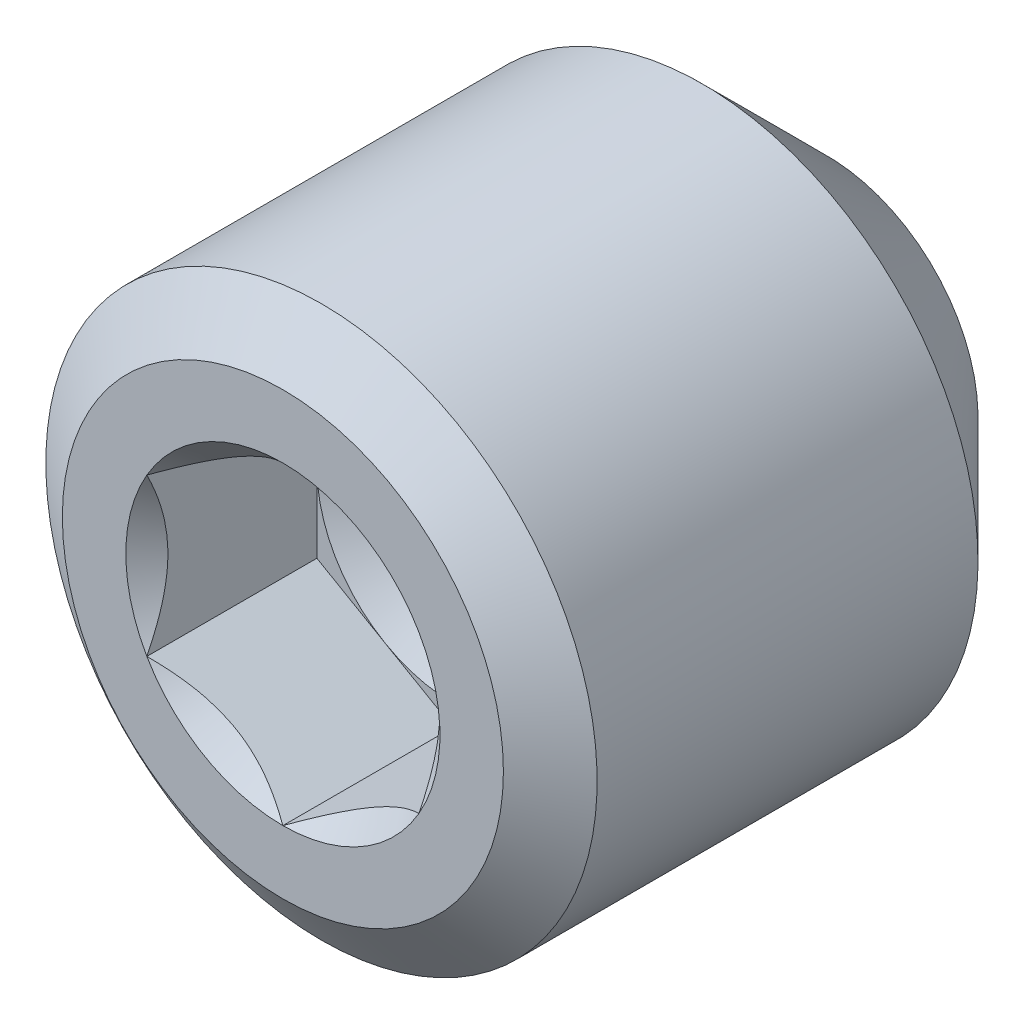
ISO-10303-21;
HEADER;
FILE_DESCRIPTION(('STEP AP214'),'2;1');
FILE_NAME('part.step','',(''),(''),'','','');
FILE_SCHEMA(('AUTOMOTIVE_DESIGN { 1 0 10303 214 1 1 1 1 }'));
ENDSEC;
DATA;
#1=APPLICATION_CONTEXT('core data for automotive mechanical design processes');
#2=APPLICATION_PROTOCOL_DEFINITION('international standard','automotive_design',2000,#1);
#3=PRODUCT_CONTEXT('',#1,'mechanical');
#4=PRODUCT('Part','Part','',(#3));
#5=PRODUCT_RELATED_PRODUCT_CATEGORY('part','',(#4));
#6=PRODUCT_DEFINITION_FORMATION('','',#4);
#7=PRODUCT_DEFINITION_CONTEXT('part definition',#1,'design');
#8=PRODUCT_DEFINITION('design','',#6,#7);
#9=PRODUCT_DEFINITION_SHAPE('','',#8);
#10=(LENGTH_UNIT() NAMED_UNIT(*) SI_UNIT(.MILLI.,.METRE.));
#11=(NAMED_UNIT(*) PLANE_ANGLE_UNIT() SI_UNIT($,.RADIAN.));
#12=(NAMED_UNIT(*) SI_UNIT($,.STERADIAN.) SOLID_ANGLE_UNIT());
#13=UNCERTAINTY_MEASURE_WITH_UNIT(LENGTH_MEASURE(1.E-05),#10,'distance_accuracy_value','');
#14=(GEOMETRIC_REPRESENTATION_CONTEXT(3) GLOBAL_UNCERTAINTY_ASSIGNED_CONTEXT((#13)) GLOBAL_UNIT_ASSIGNED_CONTEXT((#10,
#11,#12)) REPRESENTATION_CONTEXT('',''));
#15=CARTESIAN_POINT('',(0.,0.,0.));
#16=DIRECTION('',(0.,0.,1.));
#17=DIRECTION('',(1.,0.,0.));
#18=AXIS2_PLACEMENT_3D('',#15,#16,#17);
#19=CARTESIAN_POINT('',(0.,0.,0.495727982126937));
#20=DIRECTION('',(0.,0.,1.));
#21=DIRECTION('',(0.,-1.,0.));
#22=AXIS2_PLACEMENT_3D('',#19,#20,#21);
#23=CONICAL_SURFACE('',#22,1.19062499987876,1.04719755103086);
#24=CARTESIAN_POINT('',(2.55795384873636E-10,0.,-0.19167968210354));
#25=VERTEX_POINT('',#24);
#26=VERTEX_LOOP('',#25);
#27=FACE_BOUND('',#26,.T.);
#28=CARTESIAN_POINT('',(0.,0.,0.495727982192574));
#29=DIRECTION('',(0.,0.,1.));
#30=DIRECTION('',(0.,-1.,0.));
#31=AXIS2_PLACEMENT_3D('',#28,#29,#30);
#32=CIRCLE('',#31,1.19062499999245);
#33=CARTESIAN_POINT('',(1.19062499999623,0.,0.495727982183542));
#34=VERTEX_POINT('',#33);
#35=CARTESIAN_POINT('',(0.595312499998112,-1.03111149637757,0.495727982183542));
#36=VERTEX_POINT('',#35);
#37=EDGE_CURVE('E101',#34,#36,#32,.F.);
#38=ORIENTED_EDGE('',*,*,#37,.F.);
#39=CARTESIAN_POINT('',(0.,0.,0.495727982192574));
#40=DIRECTION('',(0.,0.,1.));
#41=DIRECTION('',(0.,-1.,0.));
#42=AXIS2_PLACEMENT_3D('',#39,#40,#41);
#43=CIRCLE('',#42,1.19062499999245);
#44=CARTESIAN_POINT('',(0.59531249999812,1.03111149637759,0.495727982183542));
#45=VERTEX_POINT('',#44);
#46=EDGE_CURVE('E115',#45,#34,#43,.F.);
#47=ORIENTED_EDGE('',*,*,#46,.F.);
#48=CARTESIAN_POINT('',(0.,0.,0.495727982192574));
#49=DIRECTION('',(0.,0.,1.));
#50=DIRECTION('',(0.,-1.,0.));
#51=AXIS2_PLACEMENT_3D('',#48,#49,#50);
#52=CIRCLE('',#51,1.19062499999245);
#53=CARTESIAN_POINT('',(-0.595312499998102,1.0311114963776,0.495727982183538));
#54=VERTEX_POINT('',#53);
#55=EDGE_CURVE('E253',#54,#45,#52,.F.);
#56=ORIENTED_EDGE('',*,*,#55,.F.);
#57=CARTESIAN_POINT('',(0.,0.,0.495727982192574));
#58=DIRECTION('',(0.,0.,1.));
#59=DIRECTION('',(0.,-1.,0.));
#60=AXIS2_PLACEMENT_3D('',#57,#58,#59);
#61=CIRCLE('',#60,1.19062499999245);
#62=CARTESIAN_POINT('',(-1.19062499999622,1.30013777685213E-13,0.495727982183538));
#63=VERTEX_POINT('',#62);
#64=EDGE_CURVE('E152',#63,#54,#61,.F.);
#65=ORIENTED_EDGE('',*,*,#64,.F.);
#66=CARTESIAN_POINT('',(0.,0.,0.495727982192574));
#67=DIRECTION('',(0.,0.,1.));
#68=DIRECTION('',(0.,-1.,0.));
#69=AXIS2_PLACEMENT_3D('',#66,#67,#68);
#70=CIRCLE('',#69,1.19062499999245);
#71=CARTESIAN_POINT('',(-0.595312499998087,-1.03111149637758,0.495727982183542));
#72=VERTEX_POINT('',#71);
#73=EDGE_CURVE('E20',#72,#63,#70,.F.);
#74=ORIENTED_EDGE('',*,*,#73,.F.);
#75=CARTESIAN_POINT('',(0.,0.,0.495727982192574));
#76=DIRECTION('',(0.,0.,1.));
#77=DIRECTION('',(0.,-1.,0.));
#78=AXIS2_PLACEMENT_3D('',#75,#76,#77);
#79=CIRCLE('',#78,1.19062499999245);
#80=EDGE_CURVE('E374',#36,#72,#79,.F.);
#81=ORIENTED_EDGE('',*,*,#80,.F.);
#82=EDGE_LOOP('',(#38,#47,#56,#65,#74,#81));
#83=FACE_BOUND('',#82,.T.);
#84=ADVANCED_FACE('F17',(#27,#83),#23,.F.);
#85=CARTESIAN_POINT('',(-1.190625,2.06222299276171,0.49572798217451));
#86=DIRECTION('',(0.,0.,1.));
#87=DIRECTION('',(0.,-1.,0.));
#88=AXIS2_PLACEMENT_3D('',#85,#86,#87);
#89=PLANE('',#88);
#90=DIRECTION('',(0.,-1.,0.));
#91=VECTOR('',#90,1.);
#92=CARTESIAN_POINT('',(-1.190625,0.687407664253913,0.49572798217451));
#93=LINE('',#92,#91);
#94=CARTESIAN_POINT('',(-1.19062500000001,-0.687407664253882,0.49572798217451));
#95=VERTEX_POINT('',#94);
#96=EDGE_CURVE('E84',#63,#95,#93,.T.);
#97=ORIENTED_EDGE('',*,*,#96,.T.);
#98=DIRECTION('',(0.866025403784438,-0.500000000000001,0.));
#99=VECTOR('',#98,1.);
#100=CARTESIAN_POINT('',(-1.190625,-0.687407664253889,0.49572798217451));
#101=LINE('',#100,#99);
#102=EDGE_CURVE('E168',#95,#72,#101,.T.);
#103=ORIENTED_EDGE('',*,*,#102,.T.);
#104=ORIENTED_EDGE('',*,*,#73,.T.);
#105=EDGE_LOOP('',(#97,#103,#104));
#106=FACE_BOUND('',#105,.T.);
#107=ADVANCED_FACE('F270',(#106),#89,.T.);
#108=CARTESIAN_POINT('',(-1.190625,2.06222299276171,0.49572798217451));
#109=DIRECTION('',(0.,0.,1.));
#110=DIRECTION('',(0.,-1.,0.));
#111=AXIS2_PLACEMENT_3D('',#108,#109,#110);
#112=PLANE('',#111);
#113=DIRECTION('',(0.866025403784438,-0.500000000000001,0.));
#114=VECTOR('',#113,1.);
#115=CARTESIAN_POINT('',(-1.190625,-0.687407664253889,0.495727982174503));
#116=LINE('',#115,#114);
#117=CARTESIAN_POINT('',(0.,-1.37481532850779,0.495727982174507));
#118=VERTEX_POINT('',#117);
#119=EDGE_CURVE('E134',#72,#118,#116,.T.);
#120=ORIENTED_EDGE('',*,*,#119,.T.);
#121=DIRECTION('',(0.866025403784439,0.5,0.));
#122=VECTOR('',#121,1.);
#123=CARTESIAN_POINT('',(0.,-1.37481532850779,0.49572798217451));
#124=LINE('',#123,#122);
#125=EDGE_CURVE('E106',#118,#36,#124,.T.);
#126=ORIENTED_EDGE('',*,*,#125,.T.);
#127=ORIENTED_EDGE('',*,*,#80,.T.);
#128=EDGE_LOOP('',(#120,#126,#127));
#129=FACE_BOUND('',#128,.T.);
#130=ADVANCED_FACE('F268',(#129),#112,.T.);
#131=CARTESIAN_POINT('',(-1.190625,2.06222299276171,0.49572798217451));
#132=DIRECTION('',(0.,0.,1.));
#133=DIRECTION('',(0.,-1.,0.));
#134=AXIS2_PLACEMENT_3D('',#131,#132,#133);
#135=PLANE('',#134);
#136=DIRECTION('',(0.866025403784439,0.5,0.));
#137=VECTOR('',#136,1.);
#138=CARTESIAN_POINT('',(0.,-1.37481532850779,0.49572798217451));
#139=LINE('',#138,#137);
#140=CARTESIAN_POINT('',(1.19062500000001,-0.687407664253884,0.49572798217451));
#141=VERTEX_POINT('',#140);
#142=EDGE_CURVE('E96',#36,#141,#139,.T.);
#143=ORIENTED_EDGE('',*,*,#142,.T.);
#144=DIRECTION('',(0.,1.,0.));
#145=VECTOR('',#144,1.);
#146=CARTESIAN_POINT('',(1.19062500000001,-0.687407664253889,0.49572798217451));
#147=LINE('',#146,#145);
#148=EDGE_CURVE('E99',#141,#34,#147,.T.);
#149=ORIENTED_EDGE('',*,*,#148,.T.);
#150=ORIENTED_EDGE('',*,*,#37,.T.);
#151=EDGE_LOOP('',(#143,#149,#150));
#152=FACE_BOUND('',#151,.T.);
#153=ADVANCED_FACE('F98',(#152),#135,.T.);
#154=CARTESIAN_POINT('',(-1.190625,2.06222299276171,0.49572798217451));
#155=DIRECTION('',(0.,0.,1.));
#156=DIRECTION('',(0.,-1.,0.));
#157=AXIS2_PLACEMENT_3D('',#154,#155,#156);
#158=PLANE('',#157);
#159=DIRECTION('',(0.,1.,0.));
#160=VECTOR('',#159,1.);
#161=CARTESIAN_POINT('',(1.19062500000001,-0.687407664253889,0.495727982174509));
#162=LINE('',#161,#160);
#163=CARTESIAN_POINT('',(1.19062500000003,0.687407664253898,0.495727982174509));
#164=VERTEX_POINT('',#163);
#165=EDGE_CURVE('E114',#34,#164,#162,.T.);
#166=ORIENTED_EDGE('',*,*,#165,.T.);
#167=DIRECTION('',(-0.866025403784438,0.500000000000001,0.));
#168=VECTOR('',#167,1.);
#169=CARTESIAN_POINT('',(1.19062500000001,0.687407664253913,0.49572798217451));
#170=LINE('',#169,#168);
#171=EDGE_CURVE('E125',#164,#45,#170,.T.);
#172=ORIENTED_EDGE('',*,*,#171,.T.);
#173=ORIENTED_EDGE('',*,*,#46,.T.);
#174=EDGE_LOOP('',(#166,#172,#173));
#175=FACE_BOUND('',#174,.T.);
#176=ADVANCED_FACE('F261',(#175),#158,.T.);
#177=CARTESIAN_POINT('',(1.19062500000001,-0.687407664253889,0.49572798217451));
#178=DIRECTION('',(1.,0.,0.));
#179=DIRECTION('',(0.,1.,0.));
#180=AXIS2_PLACEMENT_3D('',#177,#178,#179);
#181=PLANE('',#180);
#182=CARTESIAN_POINT('',(1.19062499999567,0.687407664292412,1.98400923211493));
#183=CARTESIAN_POINT('',(1.19062499999845,0.64046328207789,1.96055894231477));
#184=CARTESIAN_POINT('',(1.19062499999959,0.592738991388445,1.9384779182468));
#185=CARTESIAN_POINT('',(1.19062500000044,0.495406225216116,1.89800295513959));
#186=CARTESIAN_POINT('',(1.19062500000013,0.44578762950972,1.87963356850329));
#187=CARTESIAN_POINT('',(1.1906249999999,0.345116375712698,1.84791358583569));
#188=CARTESIAN_POINT('',(1.19062499999999,0.294069215443057,1.83454600462254));
#189=CARTESIAN_POINT('',(1.19062500000004,0.190855854638069,1.81396603547193));
#190=CARTESIAN_POINT('',(1.19062500000002,0.138693632939681,1.80673461351588));
#191=CARTESIAN_POINT('',(1.19062500000001,0.0719511128628457,1.80190389372895));
#192=CARTESIAN_POINT('',(1.19062500000001,0.0575681065477679,1.80112291749238));
#193=CARTESIAN_POINT('',(1.19062500000001,0.0287907386471924,1.80008032792779));
#194=CARTESIAN_POINT('',(1.19062500000001,0.0143963874866042,1.79981843246661));
#195=CARTESIAN_POINT('',(1.19062500000001,-0.0361321030513867,1.79982008619966));
#196=CARTESIAN_POINT('',(1.19062500000001,-0.0722770331511759,1.80147394594884));
#197=CARTESIAN_POINT('',(1.19062500000001,-0.144284982609329,1.80799116289963));
#198=CARTESIAN_POINT('',(1.19062500000001,-0.180147787674807,1.81285675864882));
#199=CARTESIAN_POINT('',(1.19062500000001,-0.287258251714067,1.83196696983393));
#200=CARTESIAN_POINT('',(1.19062500000001,-0.35772529740189,1.85072176782421));
#201=CARTESIAN_POINT('',(1.19062500000001,-0.471552892507442,1.88908925370762));
#202=CARTESIAN_POINT('',(1.19062500000001,-0.515840765958847,1.90614997876308));
#203=CARTESIAN_POINT('',(1.19062500000001,-0.602739573147029,1.94312607455083));
#204=CARTESIAN_POINT('',(1.19062500000001,-0.645362139970547,1.96301390794479));
#205=CARTESIAN_POINT('',(1.19062500000001,-0.687407664293118,1.98400923211292));
#206=B_SPLINE_CURVE_WITH_KNOTS('',3,(#182,#183,#184,#185,#186,#187,#188,#189,#190,#191,#192,
#193,#194,#195,#196,#197,#198,#199,#200,#201,#202,#203,#204,#205),.UNSPECIFIED.,.F.,.F.,(4,2,2,
2,2,2,2,2,2,2,2,4),(0.,0.157535403142992,0.316081041540045,0.474083294698365,0.631593623243647,
0.674799715139207,0.717982317014592,0.826362160391399,0.934817623300469,1.15262451060987,
1.29491478060776,1.43590359051227),.UNSPECIFIED.);
#207=CARTESIAN_POINT('',(1.19062500005789,0.687407664240221,1.98400923213658));
#208=VERTEX_POINT('',#207);
#209=CARTESIAN_POINT('',(1.19062500002894,-0.687407664270611,1.98400923212671));
#210=VERTEX_POINT('',#209);
#211=EDGE_CURVE('E160',#208,#210,#206,.T.);
#212=ORIENTED_EDGE('',*,*,#211,.F.);
#213=DIRECTION('',(0.,0.,1.));
#214=VECTOR('',#213,1.);
#215=CARTESIAN_POINT('',(1.19062500000003,0.687407664253898,0.49572798217451));
#216=LINE('',#215,#214);
#217=EDGE_CURVE('E140',#208,#164,#216,.F.);
#218=ORIENTED_EDGE('',*,*,#217,.T.);
#219=ORIENTED_EDGE('',*,*,#165,.F.);
#220=ORIENTED_EDGE('',*,*,#148,.F.);
#221=DIRECTION('',(0.,0.,1.));
#222=VECTOR('',#221,1.);
#223=CARTESIAN_POINT('',(1.19062500000001,-0.687407664253884,0.49572798217451));
#224=LINE('',#223,#222);
#225=EDGE_CURVE('E105',#141,#210,#224,.T.);
#226=ORIENTED_EDGE('',*,*,#225,.T.);
#227=EDGE_LOOP('',(#212,#218,#219,#220,#226));
#228=FACE_BOUND('',#227,.T.);
#229=ADVANCED_FACE('F111',(#228),#181,.F.);
#230=CARTESIAN_POINT('',(-1.190625,2.06222299276171,0.49572798217451));
#231=DIRECTION('',(0.,0.,1.));
#232=DIRECTION('',(0.,-1.,0.));
#233=AXIS2_PLACEMENT_3D('',#230,#231,#232);
#234=PLANE('',#233);
#235=DIRECTION('',(-0.866025403784438,0.500000000000001,0.));
#236=VECTOR('',#235,1.);
#237=CARTESIAN_POINT('',(1.19062500000001,0.687407664253913,0.495727982174503));
#238=LINE('',#237,#236);
#239=CARTESIAN_POINT('',(0.,1.37481532850782,0.495727982174503));
#240=VERTEX_POINT('',#239);
#241=EDGE_CURVE('E137',#45,#240,#238,.T.);
#242=ORIENTED_EDGE('',*,*,#241,.T.);
#243=DIRECTION('',(-0.866025403784439,-0.5,0.));
#244=VECTOR('',#243,1.);
#245=CARTESIAN_POINT('',(0.,1.37481532850781,0.495727982174503));
#246=LINE('',#245,#244);
#247=EDGE_CURVE('E143',#240,#54,#246,.T.);
#248=ORIENTED_EDGE('',*,*,#247,.T.);
#249=ORIENTED_EDGE('',*,*,#55,.T.);
#250=EDGE_LOOP('',(#242,#248,#249));
#251=FACE_BOUND('',#250,.T.);
#252=ADVANCED_FACE('F260',(#251),#234,.T.);
#253=CARTESIAN_POINT('',(-1.190625,2.06222299276171,0.49572798217451));
#254=DIRECTION('',(0.,0.,1.));
#255=DIRECTION('',(0.,-1.,0.));
#256=AXIS2_PLACEMENT_3D('',#253,#254,#255);
#257=PLANE('',#256);
#258=DIRECTION('',(-0.866025403784439,-0.5,0.));
#259=VECTOR('',#258,1.);
#260=CARTESIAN_POINT('',(0.,1.37481532850781,0.495727982174501));
#261=LINE('',#260,#259);
#262=CARTESIAN_POINT('',(-1.190625,0.687407664253916,0.495727982174502));
#263=VERTEX_POINT('',#262);
#264=EDGE_CURVE('E146',#54,#263,#261,.T.);
#265=ORIENTED_EDGE('',*,*,#264,.T.);
#266=DIRECTION('',(0.,-1.,0.));
#267=VECTOR('',#266,1.);
#268=CARTESIAN_POINT('',(-1.190625,0.687407664253913,0.495727982174503));
#269=LINE('',#268,#267);
#270=EDGE_CURVE('E149',#263,#63,#269,.T.);
#271=ORIENTED_EDGE('',*,*,#270,.T.);
#272=ORIENTED_EDGE('',*,*,#64,.T.);
#273=EDGE_LOOP('',(#265,#271,#272));
#274=FACE_BOUND('',#273,.T.);
#275=ADVANCED_FACE('F360',(#274),#257,.T.);
#276=CARTESIAN_POINT('',(-1.190625,0.687407664253913,0.495727982174503));
#277=DIRECTION('',(-1.,0.,0.));
#278=DIRECTION('',(0.,-1.,0.));
#279=AXIS2_PLACEMENT_3D('',#276,#277,#278);
#280=PLANE('',#279);
#281=CARTESIAN_POINT('',(-1.19062499999689,0.687407664295069,1.98400923211557));
#282=CARTESIAN_POINT('',(-1.19062499999888,0.640154592187732,1.96040536744382));
#283=CARTESIAN_POINT('',(-1.1906249999997,0.592111444465279,1.93818802847305));
#284=CARTESIAN_POINT('',(-1.1906250000003,0.494146535985991,1.89750902941694));
#285=CARTESIAN_POINT('',(-1.19062500000008,0.444215463852093,1.87906999571823));
#286=CARTESIAN_POINT('',(-1.19062499999992,0.34353191261821,1.84748380274731));
#287=CARTESIAN_POINT('',(-1.19062499999998,0.292805060660136,1.83425727427473));
#288=CARTESIAN_POINT('',(-1.19062500000002,0.19023488957445,1.81387930355028));
#289=CARTESIAN_POINT('',(-1.190625,0.138394701629495,1.80671265556526));
#290=CARTESIAN_POINT('',(-1.19062499999999,0.0490434171471756,1.80024610055994));
#291=CARTESIAN_POINT('',(-1.190625,0.0116476312291625,1.79928918177737));
#292=CARTESIAN_POINT('',(-1.190625,-0.0630781169061416,1.80090396128143));
#293=CARTESIAN_POINT('',(-1.190625,-0.100408062759505,1.80347643902957));
#294=CARTESIAN_POINT('',(-1.190625,-0.174707550763351,1.81200130363095));
#295=CARTESIAN_POINT('',(-1.190625,-0.211676725216807,1.81795683341918));
#296=CARTESIAN_POINT('',(-1.190625,-0.284997830944034,1.83292705321312));
#297=CARTESIAN_POINT('',(-1.190625,-0.321349490320898,1.84194305589422));
#298=CARTESIAN_POINT('',(-1.190625,-0.414409407701737,1.86868846791361));
#299=CARTESIAN_POINT('',(-1.190625,-0.47053205911329,1.88842523325998));
#300=CARTESIAN_POINT('',(-1.190625,-0.580581647456373,1.93288237138799));
#301=CARTESIAN_POINT('',(-1.190625,-0.634515062273283,1.95758652132262));
#302=CARTESIAN_POINT('',(-1.190625,-0.687407664295433,1.98400923211406));
#303=B_SPLINE_CURVE_WITH_KNOTS('',3,(#281,#282,#283,#284,#285,#286,#287,#288,#289,#290,#291,
#292,#293,#294,#295,#296,#297,#298,#299,#300,#301,#302),.UNSPECIFIED.,.F.,.F.,(4,2,2,2,2,2,2,2,
2,2,4),(0.,0.158570945782174,0.318065397827539,0.475027617267219,0.631594801071171,
0.743660160759135,0.855750273884749,0.967944692071428,1.08018729279008,1.25836291045195,
1.43596581394394),.UNSPECIFIED.);
#304=CARTESIAN_POINT('',(-1.19062500002893,0.687407664270642,1.98400923212671));
#305=VERTEX_POINT('',#304);
#306=CARTESIAN_POINT('',(-1.19062500005789,-0.687407664241365,1.98400923213716));
#307=VERTEX_POINT('',#306);
#308=EDGE_CURVE('E315',#305,#307,#303,.T.);
#309=ORIENTED_EDGE('',*,*,#308,.T.);
#310=DIRECTION('',(0.,0.,1.));
#311=VECTOR('',#310,1.);
#312=CARTESIAN_POINT('',(-1.19062500000001,-0.687407664253882,0.49572798217451));
#313=LINE('',#312,#311);
#314=EDGE_CURVE('E132',#307,#95,#313,.F.);
#315=ORIENTED_EDGE('',*,*,#314,.T.);
#316=ORIENTED_EDGE('',*,*,#96,.F.);
#317=ORIENTED_EDGE('',*,*,#270,.F.);
#318=DIRECTION('',(0.,0.,1.));
#319=VECTOR('',#318,1.);
#320=CARTESIAN_POINT('',(-1.190625,0.687407664253916,0.495727982174503));
#321=LINE('',#320,#319);
#322=EDGE_CURVE('E156',#263,#305,#321,.T.);
#323=ORIENTED_EDGE('',*,*,#322,.T.);
#324=EDGE_LOOP('',(#309,#315,#316,#317,#323));
#325=FACE_BOUND('',#324,.T.);
#326=ADVANCED_FACE('F332',(#325),#280,.F.);
#327=CARTESIAN_POINT('',(-1.190625,-0.687407664253889,0.49572798217451));
#328=DIRECTION('',(-0.500000000000001,-0.866025403784438,0.));
#329=DIRECTION('',(0.866025403784438,-0.500000000000001,0.));
#330=AXIS2_PLACEMENT_3D('',#327,#328,#329);
#331=PLANE('',#330);
#332=CARTESIAN_POINT('',(-1.19062500003409,-0.687407664230629,1.98400923211556));
#333=CARTESIAN_POINT('',(-1.14970263918327,-0.711034200286016,1.96040536744382));
#334=CARTESIAN_POINT('',(-1.10809605277826,-0.73505577414795,1.93818802847304));
#335=CARTESIAN_POINT('',(-1.02325595335608,-0.784038228388114,1.89750902941694));
#336=CARTESIAN_POINT('',(-0.980014376449825,-0.809003764454871,1.87906999571824));
#337=CARTESIAN_POINT('',(-0.892819863337972,-0.859345540071674,1.84748380274731));
#338=CARTESIAN_POINT('',(-0.848889120888296,-0.884708966050761,1.83425727427474));
#339=CARTESIAN_POINT('',(-0.760060747057598,-0.93599405159364,1.81387930355029));
#340=CARTESIAN_POINT('',(-0.7151658273603,-0.961914145566103,1.80671265556527));
#341=CARTESIAN_POINT('',(-0.637785345137838,-1.00658978780726,1.80024610055994));
#342=CARTESIAN_POINT('',(-0.605399644538355,-1.02528768076626,1.79928918177737));
#343=CARTESIAN_POINT('',(-0.540685248336385,-1.06265055483392,1.80090396128143));
#344=CARTESIAN_POINT('',(-0.508356566905474,-1.0813155277606,1.80347643902958));
#345=CARTESIAN_POINT('',(-0.444011322805966,-1.11846527176252,1.81200130363096));
#346=CARTESIAN_POINT('',(-0.411995078572333,-1.13694985898925,1.81795683341919));
#347=CARTESIAN_POINT('',(-0.348497138378991,-1.17361041185286,1.83292705321313));
#348=CARTESIAN_POINT('',(-0.317015677888907,-1.1917862415413,1.84194305589423));
#349=CARTESIAN_POINT('',(-0.23642342536302,-1.23831620023172,1.86868846791362));
#350=CARTESIAN_POINT('',(-0.187819783512878,-1.26637752593749,1.88842523325998));
#351=CARTESIAN_POINT('',(-0.0925140443317499,-1.32140232010903,1.932882371388));
#352=CARTESIAN_POINT('',(-0.0458063369874632,-1.34836902751749,1.95758652132262));
#353=CARTESIAN_POINT('',(3.59776575595635E-11,-1.37481532852856,1.98400923211406));
#354=B_SPLINE_CURVE_WITH_KNOTS('',3,(#332,#333,#334,#335,#336,#337,#338,#339,#340,#341,#342,
#343,#344,#345,#346,#347,#348,#349,#350,#351,#352,#353),.UNSPECIFIED.,.F.,.F.,(4,2,2,2,2,2,2,2,
2,2,4),(0.,0.158570945782172,0.318065397827535,0.475027617267213,0.631594801071163,
0.743660160759127,0.855750273884742,0.967944692071422,1.08018729279007,1.25836291045194,
1.43596581394393),.UNSPECIFIED.);
#355=CARTESIAN_POINT('',(-3.97893440011964E-11,-1.37481532855166,1.98400923213716));
#356=VERTEX_POINT('',#355);
#357=EDGE_CURVE('E320',#307,#356,#354,.T.);
#358=ORIENTED_EDGE('',*,*,#357,.T.);
#359=DIRECTION('',(0.,0.,1.));
#360=VECTOR('',#359,1.);
#361=CARTESIAN_POINT('',(0.,-1.3748153285078,0.49572798217451));
#362=LINE('',#361,#360);
#363=EDGE_CURVE('E122',#356,#118,#362,.F.);
#364=ORIENTED_EDGE('',*,*,#363,.T.);
#365=ORIENTED_EDGE('',*,*,#119,.F.);
#366=ORIENTED_EDGE('',*,*,#102,.F.);
#367=ORIENTED_EDGE('',*,*,#314,.F.);
#368=EDGE_LOOP('',(#358,#364,#365,#366,#367));
#369=FACE_BOUND('',#368,.T.);
#370=ADVANCED_FACE('F353',(#369),#331,.F.);
#371=CARTESIAN_POINT('',(0.,-1.37481532850779,0.49572798217451));
#372=DIRECTION('',(0.5,-0.866025403784439,0.));
#373=DIRECTION('',(0.866025403784439,0.5,0.));
#374=AXIS2_PLACEMENT_3D('',#371,#372,#373);
#375=PLANE('',#374);
#376=CARTESIAN_POINT('',(-3.7187299035962E-11,-1.37481532852568,1.98400923211557));
#377=CARTESIAN_POINT('',(0.0409223608156151,-1.35118879247373,1.96040536744382));
#378=CARTESIAN_POINT('',(0.0825289472214342,-1.32716721861321,1.93818802847305));
#379=CARTESIAN_POINT('',(0.167369046644212,-1.27818476437409,1.89750902941694));
#380=CARTESIAN_POINT('',(0.210610623550247,-1.25321922830695,1.87906999571824));
#381=CARTESIAN_POINT('',(0.297805136661942,-1.20287745268987,1.84748380274731));
#382=CARTESIAN_POINT('',(0.341735879111678,-1.17751402671088,1.83425727427474));
#383=CARTESIAN_POINT('',(0.430564252942422,-1.12622894116808,1.81387930355029));
#384=CARTESIAN_POINT('',(0.475459172639706,-1.10030884719558,1.80671265556527));
#385=CARTESIAN_POINT('',(0.552839654862164,-1.05563320495441,1.80024610055994));
#386=CARTESIAN_POINT('',(0.58522535546165,-1.03693531199541,1.79928918177737));
#387=CARTESIAN_POINT('',(0.649939751663623,-0.999572437927758,1.80090396128143));
#388=CARTESIAN_POINT('',(0.682268433094534,-0.980907465001075,1.80347643902958));
#389=CARTESIAN_POINT('',(0.746613677194042,-0.943757720999152,1.81200130363096));
#390=CARTESIAN_POINT('',(0.778629921427674,-0.925273133772424,1.81795683341919));
#391=CARTESIAN_POINT('',(0.842127861621015,-0.888612580908812,1.83292705321313));
#392=CARTESIAN_POINT('',(0.873609322111098,-0.87043675122038,1.84194305589423));
#393=CARTESIAN_POINT('',(0.954201574636604,-0.82390679253018,1.86868846791349));
#394=CARTESIAN_POINT('',(1.00280521648638,-0.795845466824616,1.88842523325968));
#395=CARTESIAN_POINT('',(1.0981109556668,-0.740820672653482,1.93288237138728));
#396=CARTESIAN_POINT('',(1.14481866301075,-0.713853965245223,1.95758652132166));
#397=CARTESIAN_POINT('',(1.19062500003387,-0.687407664234335,1.98400923211284));
#398=B_SPLINE_CURVE_WITH_KNOTS('',3,(#376,#377,#378,#379,#380,#381,#382,#383,#384,#385,#386,
#387,#388,#389,#390,#391,#392,#393,#394,#395,#396,#397),.UNSPECIFIED.,.F.,.F.,(4,2,2,2,2,2,2,2,
2,2,4),(0.,0.158570945782166,0.318065397827523,0.475027617267209,0.631594801071167,
0.743660160759134,0.855750273884751,0.967944692071429,1.08018729279008,1.25836291045058,
1.43596581394121),.UNSPECIFIED.);
#399=EDGE_CURVE('E120',#356,#210,#398,.T.);
#400=ORIENTED_EDGE('',*,*,#399,.T.);
#401=ORIENTED_EDGE('',*,*,#225,.F.);
#402=ORIENTED_EDGE('',*,*,#142,.F.);
#403=ORIENTED_EDGE('',*,*,#125,.F.);
#404=ORIENTED_EDGE('',*,*,#363,.F.);
#405=EDGE_LOOP('',(#400,#401,#402,#403,#404));
#406=FACE_BOUND('',#405,.T.);
#407=ADVANCED_FACE('F117',(#406),#375,.F.);
#408=CARTESIAN_POINT('',(1.19062500000001,0.687407664253913,0.49572798217451));
#409=DIRECTION('',(0.500000000000001,0.866025403784438,0.));
#410=DIRECTION('',(-0.866025403784438,0.500000000000001,0.));
#411=AXIS2_PLACEMENT_3D('',#408,#409,#410);
#412=PLANE('',#411);
#413=CARTESIAN_POINT('',(1.19062500003121,0.687407664230863,1.98400923211496));
#414=CARTESIAN_POINT('',(1.14970263918109,0.711034200286776,1.96040536744301));
#415=CARTESIAN_POINT('',(1.10809605277648,0.735055774148869,1.93818802847223));
#416=CARTESIAN_POINT('',(1.02325595335481,0.784038228389021,1.89750902941629));
#417=CARTESIAN_POINT('',(0.98001437644867,0.809003764455603,1.87906999571776));
#418=CARTESIAN_POINT('',(0.892819863337155,0.859345540072137,1.84748380274708));
#419=CARTESIAN_POINT('',(0.848889120887694,0.884708966051127,1.83425727427459));
#420=CARTESIAN_POINT('',(0.760060747057411,0.935994051593785,1.81387930355026));
#421=CARTESIAN_POINT('',(0.715165827360314,0.961914145566125,1.80671265556529));
#422=CARTESIAN_POINT('',(0.637785345138079,1.00658978780714,1.80024610055996));
#423=CARTESIAN_POINT('',(0.605399644538619,1.02528768076614,1.79928918177738));
#424=CARTESIAN_POINT('',(0.540685248336694,1.06265055483377,1.80090396128142));
#425=CARTESIAN_POINT('',(0.508356566905804,1.08131552776044,1.80347643902955));
#426=CARTESIAN_POINT('',(0.444011322806335,1.11846527176234,1.8120013036309));
#427=CARTESIAN_POINT('',(0.411995078572721,1.13694985898905,1.81795683341912));
#428=CARTESIAN_POINT('',(0.348497138379412,1.17361041185265,1.83292705321302));
#429=CARTESIAN_POINT('',(0.317015677889345,1.19178624154107,1.8419430558941));
#430=CARTESIAN_POINT('',(0.236423425363389,1.23831620023153,1.86868846791348));
#431=CARTESIAN_POINT('',(0.187819783513164,1.26637752593735,1.88842523325986));
#432=CARTESIAN_POINT('',(0.0925140443318827,1.32140232010898,1.93288237138793));
#433=CARTESIAN_POINT('',(0.0458063369875248,1.34836902751748,1.9575865213226));
#434=CARTESIAN_POINT('',(-3.59844204254258E-11,1.37481532852859,1.98400923211407));
#435=B_SPLINE_CURVE_WITH_KNOTS('',3,(#413,#414,#415,#416,#417,#418,#419,#420,#421,#422,#423,
#424,#425,#426,#427,#428,#429,#430,#431,#432,#433,#434),.UNSPECIFIED.,.F.,.F.,(4,2,2,2,2,2,2,2,
2,2,4),(0.,0.158570945781483,0.318065397826116,0.475027617265063,0.631594801068299,
0.743660160756186,0.855750273881723,0.967944692068335,1.08018729278692,1.25836291044907,
1.43596581394133),.UNSPECIFIED.);
#436=CARTESIAN_POINT('',(3.97830534634665E-11,1.37481532855168,1.98400923213717));
#437=VERTEX_POINT('',#436);
#438=EDGE_CURVE('E35',#208,#437,#435,.T.);
#439=ORIENTED_EDGE('',*,*,#438,.T.);
#440=DIRECTION('',(0.,0.,1.));
#441=VECTOR('',#440,1.);
#442=CARTESIAN_POINT('',(0.,1.37481532850782,0.495727982174503));
#443=LINE('',#442,#441);
#444=EDGE_CURVE('E313',#437,#240,#443,.F.);
#445=ORIENTED_EDGE('',*,*,#444,.T.);
#446=ORIENTED_EDGE('',*,*,#241,.F.);
#447=ORIENTED_EDGE('',*,*,#171,.F.);
#448=ORIENTED_EDGE('',*,*,#217,.F.);
#449=EDGE_LOOP('',(#439,#445,#446,#447,#448));
#450=FACE_BOUND('',#449,.T.);
#451=ADVANCED_FACE('F352',(#450),#412,.F.);
#452=CARTESIAN_POINT('',(0.,1.37481532850781,0.495727982174503));
#453=DIRECTION('',(-0.5,0.866025403784439,0.));
#454=DIRECTION('',(-0.866025403784439,-0.5,0.));
#455=AXIS2_PLACEMENT_3D('',#452,#453,#454);
#456=PLANE('',#455);
#457=CARTESIAN_POINT('',(3.7170576648238E-11,1.37481532852571,1.98400923211556));
#458=CARTESIAN_POINT('',(-0.0409223608156309,1.35118879247375,1.96040536744381));
#459=CARTESIAN_POINT('',(-0.0825289472214504,1.32716721861323,1.93818802847304));
#460=CARTESIAN_POINT('',(-0.16736904664423,1.2781847643741,1.89750902941694));
#461=CARTESIAN_POINT('',(-0.210610623550268,1.25321922830696,1.87906999571824));
#462=CARTESIAN_POINT('',(-0.297805136661962,1.20287745268989,1.84748380274731));
#463=CARTESIAN_POINT('',(-0.341735879111695,1.1775140267109,1.83425727427474));
#464=CARTESIAN_POINT('',(-0.430564252942434,1.12622894116809,1.81387930355029));
#465=CARTESIAN_POINT('',(-0.475459172639716,1.1003088471956,1.80671265556527));
#466=CARTESIAN_POINT('',(-0.552839654862171,1.05563320495443,1.80024610055995));
#467=CARTESIAN_POINT('',(-0.585225355461656,1.03693531199543,1.79928918177738));
#468=CARTESIAN_POINT('',(-0.649939751663629,0.999572437927779,1.80090396128144));
#469=CARTESIAN_POINT('',(-0.682268433094539,0.980907465001097,1.80347643902958));
#470=CARTESIAN_POINT('',(-0.746613677194047,0.943757720999173,1.81200130363096));
#471=CARTESIAN_POINT('',(-0.77862992142768,0.925273133772445,1.81795683341919));
#472=CARTESIAN_POINT('',(-0.842127861621023,0.888612580908832,1.83292705321314));
#473=CARTESIAN_POINT('',(-0.873609322111106,0.870436751220399,1.84194305589423));
#474=CARTESIAN_POINT('',(-0.954201574636989,0.823906792529982,1.86868846791362));
#475=CARTESIAN_POINT('',(-1.00280521648713,0.795845466824209,1.88842523325999));
#476=CARTESIAN_POINT('',(-1.09811095566825,0.740820672652673,1.932882371388));
#477=CARTESIAN_POINT('',(-1.14481866301253,0.713853965244221,1.95758652132262));
#478=CARTESIAN_POINT('',(-1.19062500003597,0.687407664233148,1.98400923211406));
#479=B_SPLINE_CURVE_WITH_KNOTS('',3,(#457,#458,#459,#460,#461,#462,#463,#464,#465,#466,#467,
#468,#469,#470,#471,#472,#473,#474,#475,#476,#477,#478),.UNSPECIFIED.,.F.,.F.,(4,2,2,2,2,2,2,2,
2,2,4),(0.,0.158570945782171,0.318065397827532,0.47502761726721,0.631594801071159,
0.743660160759124,0.855750273884739,0.967944692071419,1.08018729279007,1.25836291045192,
1.4359658139439),.UNSPECIFIED.);
#480=EDGE_CURVE('E208',#437,#305,#479,.T.);
#481=ORIENTED_EDGE('',*,*,#480,.T.);
#482=ORIENTED_EDGE('',*,*,#322,.F.);
#483=ORIENTED_EDGE('',*,*,#264,.F.);
#484=ORIENTED_EDGE('',*,*,#247,.F.);
#485=ORIENTED_EDGE('',*,*,#444,.F.);
#486=EDGE_LOOP('',(#481,#482,#483,#484,#485));
#487=FACE_BOUND('',#486,.T.);
#488=ADVANCED_FACE('F222',(#487),#456,.F.);
#489=CARTESIAN_POINT('',(0.,0.,1.98400923216013));
#490=DIRECTION('',(0.,0.,1.));
#491=DIRECTION('',(1.,0.,0.));
#492=AXIS2_PLACEMENT_3D('',#489,#490,#491);
#493=CONICAL_SURFACE('',#492,1.37481532857464,0.785398163397448);
#494=ORIENTED_EDGE('',*,*,#308,.F.);
#495=CARTESIAN_POINT('',(0.,0.,1.98400923216013));
#496=DIRECTION('',(0.,0.,1.));
#497=DIRECTION('',(1.,0.,0.));
#498=AXIS2_PLACEMENT_3D('',#495,#496,#497);
#499=CIRCLE('',#498,1.37481532857464);
#500=EDGE_CURVE('E205',#305,#307,#499,.T.);
#501=ORIENTED_EDGE('',*,*,#500,.T.);
#502=EDGE_LOOP('',(#494,#501));
#503=FACE_BOUND('',#502,.T.);
#504=ADVANCED_FACE('F316',(#503),#493,.F.);
#505=CARTESIAN_POINT('',(0.,0.,1.98400923216013));
#506=DIRECTION('',(0.,0.,1.));
#507=DIRECTION('',(1.,0.,0.));
#508=AXIS2_PLACEMENT_3D('',#505,#506,#507);
#509=CONICAL_SURFACE('',#508,1.37481532857464,0.785398163397448);
#510=ORIENTED_EDGE('',*,*,#357,.F.);
#511=CARTESIAN_POINT('',(0.,0.,1.98400923216013));
#512=DIRECTION('',(0.,0.,1.));
#513=DIRECTION('',(1.,0.,0.));
#514=AXIS2_PLACEMENT_3D('',#511,#512,#513);
#515=CIRCLE('',#514,1.37481532857464);
#516=EDGE_CURVE('E202',#307,#356,#515,.T.);
#517=ORIENTED_EDGE('',*,*,#516,.T.);
#518=EDGE_LOOP('',(#510,#517));
#519=FACE_BOUND('',#518,.T.);
#520=ADVANCED_FACE('F336',(#519),#509,.F.);
#521=CARTESIAN_POINT('',(0.,0.,1.98400923216013));
#522=DIRECTION('',(0.,0.,1.));
#523=DIRECTION('',(1.,0.,0.));
#524=AXIS2_PLACEMENT_3D('',#521,#522,#523);
#525=CONICAL_SURFACE('',#524,1.37481532857464,0.785398163397448);
#526=ORIENTED_EDGE('',*,*,#399,.F.);
#527=CARTESIAN_POINT('',(0.,0.,1.98400923216013));
#528=DIRECTION('',(0.,0.,1.));
#529=DIRECTION('',(1.,0.,0.));
#530=AXIS2_PLACEMENT_3D('',#527,#528,#529);
#531=CIRCLE('',#530,1.37481532857464);
#532=EDGE_CURVE('E200',#356,#210,#531,.T.);
#533=ORIENTED_EDGE('',*,*,#532,.T.);
#534=EDGE_LOOP('',(#526,#533));
#535=FACE_BOUND('',#534,.T.);
#536=ADVANCED_FACE('F241',(#535),#525,.F.);
#537=CARTESIAN_POINT('',(0.,0.,1.98400923216013));
#538=DIRECTION('',(0.,0.,1.));
#539=DIRECTION('',(1.,0.,0.));
#540=AXIS2_PLACEMENT_3D('',#537,#538,#539);
#541=CONICAL_SURFACE('',#540,1.37481532857464,0.785398163550834);
#542=CARTESIAN_POINT('',(0.,0.,1.98400923216013));
#543=DIRECTION('',(0.,0.,1.));
#544=DIRECTION('',(1.,0.,0.));
#545=AXIS2_PLACEMENT_3D('',#542,#543,#544);
#546=CIRCLE('',#545,1.37481532857464);
#547=EDGE_CURVE('E197',#210,#208,#546,.T.);
#548=ORIENTED_EDGE('',*,*,#547,.T.);
#549=ORIENTED_EDGE('',*,*,#211,.T.);
#550=EDGE_LOOP('',(#548,#549));
#551=FACE_BOUND('',#550,.T.);
#552=ADVANCED_FACE('F236',(#551),#541,.F.);
#553=CARTESIAN_POINT('',(0.,0.,1.98400923216013));
#554=DIRECTION('',(0.,0.,1.));
#555=DIRECTION('',(1.,0.,0.));
#556=AXIS2_PLACEMENT_3D('',#553,#554,#555);
#557=CONICAL_SURFACE('',#556,1.37481532857464,0.785398163397448);
#558=ORIENTED_EDGE('',*,*,#438,.F.);
#559=CARTESIAN_POINT('',(0.,0.,1.98400923216013));
#560=DIRECTION('',(0.,0.,1.));
#561=DIRECTION('',(1.,0.,0.));
#562=AXIS2_PLACEMENT_3D('',#559,#560,#561);
#563=CIRCLE('',#562,1.37481532857464);
#564=EDGE_CURVE('E194',#208,#437,#563,.T.);
#565=ORIENTED_EDGE('',*,*,#564,.T.);
#566=EDGE_LOOP('',(#558,#565));
#567=FACE_BOUND('',#566,.T.);
#568=ADVANCED_FACE('F230',(#567),#557,.F.);
#569=CARTESIAN_POINT('',(0.,0.,1.98400923216013));
#570=DIRECTION('',(0.,0.,1.));
#571=DIRECTION('',(1.,0.,0.));
#572=AXIS2_PLACEMENT_3D('',#569,#570,#571);
#573=CONICAL_SURFACE('',#572,1.37481532857464,0.785398163397448);
#574=ORIENTED_EDGE('',*,*,#480,.F.);
#575=CARTESIAN_POINT('',(0.,0.,1.98400923216013));
#576=DIRECTION('',(0.,0.,1.));
#577=DIRECTION('',(1.,0.,0.));
#578=AXIS2_PLACEMENT_3D('',#575,#576,#577);
#579=CIRCLE('',#578,1.37481532857464);
#580=EDGE_CURVE('E191',#437,#305,#579,.T.);
#581=ORIENTED_EDGE('',*,*,#580,.T.);
#582=EDGE_LOOP('',(#574,#581));
#583=FACE_BOUND('',#582,.T.);
#584=ADVANCED_FACE('F225',(#583),#573,.F.);
#585=CARTESIAN_POINT('',(0.,1.32223931889029,-2.77849076782551));
#586=DIRECTION('',(0.,0.,1.));
#587=DIRECTION('',(0.,-1.,0.));
#588=AXIS2_PLACEMENT_3D('',#585,#586,#587);
#589=PLANE('',#588);
#590=CARTESIAN_POINT('',(0.,0.,-2.77849076780968));
#591=DIRECTION('',(0.,0.,1.));
#592=DIRECTION('',(0.,-1.,0.));
#593=AXIS2_PLACEMENT_3D('',#590,#591,#592);
#594=CIRCLE('',#593,1.3222393188812);
#595=CARTESIAN_POINT('',(0.,-1.3222393188812,-2.77849076780967));
#596=VERTEX_POINT('',#595);
#597=EDGE_CURVE('E188',#596,#596,#594,.T.);
#598=ORIENTED_EDGE('',*,*,#597,.F.);
#599=EDGE_LOOP('',(#598));
#600=FACE_BOUND('',#599,.T.);
#601=ADVANCED_FACE('F229',(#600),#589,.F.);
#602=CARTESIAN_POINT('',(0.,0.,1.98400923217451));
#603=DIRECTION('',(0.,0.,-1.));
#604=DIRECTION('',(0.,1.,0.));
#605=AXIS2_PLACEMENT_3D('',#602,#603,#604);
#606=PLANE('',#605);
#607=CARTESIAN_POINT('',(0.,0.,1.98400923216014));
#608=DIRECTION('',(0.,0.,-1.));
#609=DIRECTION('',(0.,1.,0.));
#610=AXIS2_PLACEMENT_3D('',#607,#608,#609);
#611=CIRCLE('',#610,1.93040000004882);
#612=CARTESIAN_POINT('',(0.,1.93040000004885,1.98400923216013));
#613=VERTEX_POINT('',#612);
#614=EDGE_CURVE('E185',#613,#613,#611,.T.);
#615=ORIENTED_EDGE('',*,*,#614,.F.);
#616=EDGE_LOOP('',(#615));
#617=FACE_BOUND('',#616,.T.);
#618=ORIENTED_EDGE('',*,*,#564,.F.);
#619=ORIENTED_EDGE('',*,*,#547,.F.);
#620=ORIENTED_EDGE('',*,*,#532,.F.);
#621=ORIENTED_EDGE('',*,*,#516,.F.);
#622=ORIENTED_EDGE('',*,*,#500,.F.);
#623=ORIENTED_EDGE('',*,*,#580,.F.);
#624=EDGE_LOOP('',(#618,#619,#620,#621,#622,#623));
#625=FACE_BOUND('',#624,.T.);
#626=ADVANCED_FACE('F293',(#617,#625),#606,.F.);
#627=CARTESIAN_POINT('',(0.,0.,-1.68773008670088));
#628=DIRECTION('',(0.,0.,1.));
#629=DIRECTION('',(0.,-1.,0.));
#630=AXIS2_PLACEMENT_3D('',#627,#628,#629);
#631=CONICAL_SURFACE('',#630,2.41299999993317,0.785398163371396);
#632=CARTESIAN_POINT('',(0.,0.,-1.68773008671579));
#633=DIRECTION('',(0.,0.,1.));
#634=DIRECTION('',(0.,-1.,0.));
#635=AXIS2_PLACEMENT_3D('',#632,#633,#634);
#636=CIRCLE('',#635,2.41299999999999);
#637=CARTESIAN_POINT('',(0.,-2.41299999999999,-1.68773008671578));
#638=VERTEX_POINT('',#637);
#639=EDGE_CURVE('E26',#638,#638,#636,.T.);
#640=ORIENTED_EDGE('',*,*,#639,.F.);
#641=EDGE_LOOP('',(#640));
#642=FACE_BOUND('',#641,.T.);
#643=ORIENTED_EDGE('',*,*,#597,.T.);
#644=EDGE_LOOP('',(#643));
#645=FACE_BOUND('',#644,.T.);
#646=ADVANCED_FACE('F287',(#642,#645),#631,.T.);
#647=CARTESIAN_POINT('',(0.,0.,1.64608907419962));
#648=DIRECTION('',(0.,0.,-1.));
#649=DIRECTION('',(0.,1.,0.));
#650=AXIS2_PLACEMENT_3D('',#647,#648,#649);
#651=CONICAL_SURFACE('',#650,2.41300000004682,0.959931088566411);
#652=CARTESIAN_POINT('',(0.,0.,1.64608907423451));
#653=DIRECTION('',(0.,0.,1.));
#654=DIRECTION('',(0.,-1.,0.));
#655=AXIS2_PLACEMENT_3D('',#652,#653,#654);
#656=CIRCLE('',#655,2.41299999999999);
#657=CARTESIAN_POINT('',(0.,-2.41299999999997,1.64608907423452));
#658=VERTEX_POINT('',#657);
#659=EDGE_CURVE('E11',#658,#658,#656,.F.);
#660=ORIENTED_EDGE('',*,*,#659,.F.);
#661=EDGE_LOOP('',(#660));
#662=FACE_BOUND('',#661,.T.);
#663=ORIENTED_EDGE('',*,*,#614,.T.);
#664=EDGE_LOOP('',(#663));
#665=FACE_BOUND('',#664,.T.);
#666=ADVANCED_FACE('F281',(#662,#665),#651,.T.);
#667=CARTESIAN_POINT('',(0.,0.,-1.9840092321745));
#668=DIRECTION('',(0.,0.,1.));
#669=DIRECTION('',(0.,-1.,0.));
#670=AXIS2_PLACEMENT_3D('',#667,#668,#669);
#671=CYLINDRICAL_SURFACE('',#670,2.41299999999999);
#672=ORIENTED_EDGE('',*,*,#659,.T.);
#673=EDGE_LOOP('',(#672));
#674=FACE_BOUND('',#673,.T.);
#675=ORIENTED_EDGE('',*,*,#639,.T.);
#676=EDGE_LOOP('',(#675));
#677=FACE_BOUND('',#676,.T.);
#678=ADVANCED_FACE('F279',(#674,#677),#671,.T.);
#679=CLOSED_SHELL('',(#84,#107,#130,#153,#176,#229,#252,#275,#326,#370,#407,#451,#488,#504,#520,
#536,#552,#568,#584,#601,#626,#646,#666,#678));
#680=MANIFOLD_SOLID_BREP('B1',#679);
#681=ADVANCED_BREP_SHAPE_REPRESENTATION('',(#18,#680),#14);
#682=SHAPE_DEFINITION_REPRESENTATION(#9,#681);
ENDSEC;
END-ISO-10303-21;
